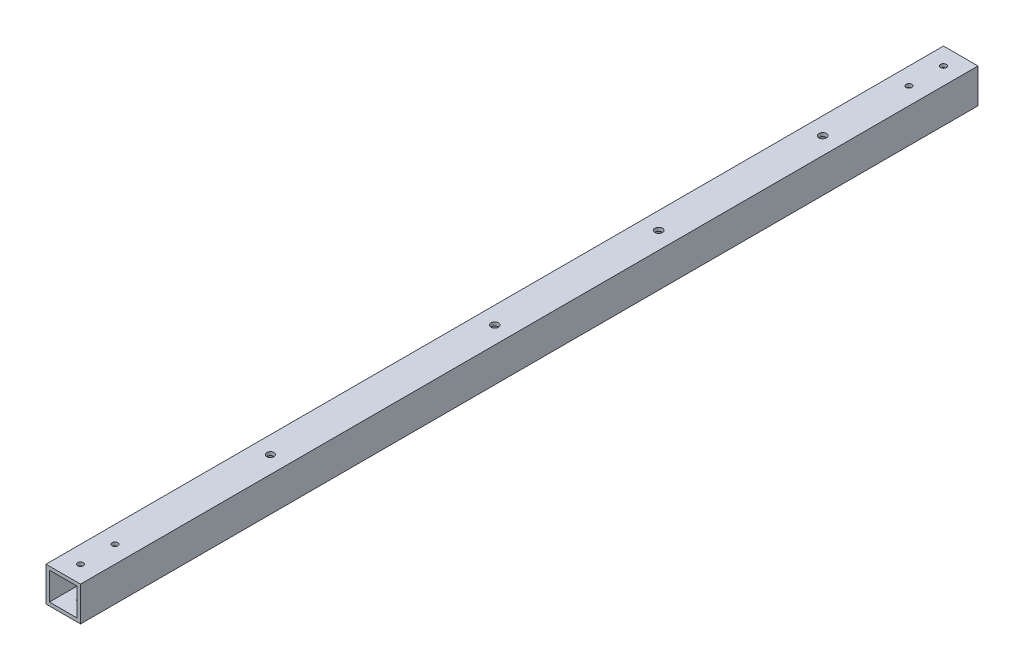
ISO-10303-21;
HEADER;
FILE_DESCRIPTION(('STEP AP214'),'2;1');
FILE_NAME('part.step','',(''),(''),'','','');
FILE_SCHEMA(('AUTOMOTIVE_DESIGN { 1 0 10303 214 1 1 1 1 }'));
ENDSEC;
DATA;
#1=APPLICATION_CONTEXT('core data for automotive mechanical design processes');
#2=APPLICATION_PROTOCOL_DEFINITION('international standard','automotive_design',2000,#1);
#3=PRODUCT_CONTEXT('',#1,'mechanical');
#4=PRODUCT('Part','Part','',(#3));
#5=PRODUCT_RELATED_PRODUCT_CATEGORY('part','',(#4));
#6=PRODUCT_DEFINITION_FORMATION('','',#4);
#7=PRODUCT_DEFINITION_CONTEXT('part definition',#1,'design');
#8=PRODUCT_DEFINITION('design','',#6,#7);
#9=PRODUCT_DEFINITION_SHAPE('','',#8);
#10=(LENGTH_UNIT() NAMED_UNIT(*) SI_UNIT(.MILLI.,.METRE.));
#11=(NAMED_UNIT(*) PLANE_ANGLE_UNIT() SI_UNIT($,.RADIAN.));
#12=(NAMED_UNIT(*) SI_UNIT($,.STERADIAN.) SOLID_ANGLE_UNIT());
#13=UNCERTAINTY_MEASURE_WITH_UNIT(LENGTH_MEASURE(1.E-05),#10,'distance_accuracy_value','');
#14=(GEOMETRIC_REPRESENTATION_CONTEXT(3) GLOBAL_UNCERTAINTY_ASSIGNED_CONTEXT((#13)) GLOBAL_UNIT_ASSIGNED_CONTEXT((#10,
#11,#12)) REPRESENTATION_CONTEXT('',''));
#15=CARTESIAN_POINT('',(0.,0.,0.));
#16=DIRECTION('',(0.,0.,1.));
#17=DIRECTION('',(1.,0.,0.));
#18=AXIS2_PLACEMENT_3D('',#15,#16,#17);
#19=CARTESIAN_POINT('',(-10.,-10.,560.));
#20=DIRECTION('',(0.,1.,0.));
#21=DIRECTION('',(0.,0.,1.));
#22=AXIS2_PLACEMENT_3D('',#19,#20,#21);
#23=PLANE('',#22);
#24=CARTESIAN_POINT('',(0.,-10.,530.));
#25=DIRECTION('',(0.,-1.,0.));
#26=DIRECTION('',(0.,0.,-1.));
#27=AXIS2_PLACEMENT_3D('',#24,#25,#26);
#28=CIRCLE('',#27,1.64999999999999);
#29=CARTESIAN_POINT('',(0.,-10.,528.35));
#30=VERTEX_POINT('',#29);
#31=EDGE_CURVE('E342',#30,#30,#28,.T.);
#32=ORIENTED_EDGE('',*,*,#31,.F.);
#33=EDGE_LOOP('',(#32));
#34=FACE_BOUND('',#33,.T.);
#35=CARTESIAN_POINT('',(0.,-10.,30.));
#36=DIRECTION('',(0.,-1.,0.));
#37=DIRECTION('',(0.,0.,-1.));
#38=AXIS2_PLACEMENT_3D('',#35,#36,#37);
#39=CIRCLE('',#38,1.64999999999999);
#40=CARTESIAN_POINT('',(0.,-10.,28.35));
#41=VERTEX_POINT('',#40);
#42=EDGE_CURVE('E361',#41,#41,#39,.T.);
#43=ORIENTED_EDGE('',*,*,#42,.F.);
#44=EDGE_LOOP('',(#43));
#45=FACE_BOUND('',#44,.T.);
#46=DIRECTION('',(1.,0.,0.));
#47=VECTOR('',#46,1.);
#48=CARTESIAN_POINT('',(-10.,-10.,540.));
#49=LINE('',#48,#47);
#50=CARTESIAN_POINT('',(-10.,-10.,540.));
#51=VERTEX_POINT('',#50);
#52=CARTESIAN_POINT('',(10.,-10.,540.));
#53=VERTEX_POINT('',#52);
#54=EDGE_CURVE('E200',#51,#53,#49,.T.);
#55=ORIENTED_EDGE('',*,*,#54,.F.);
#56=DIRECTION('',(0.,0.,-1.));
#57=VECTOR('',#56,1.);
#58=CARTESIAN_POINT('',(-10.,-10.,560.));
#59=LINE('',#58,#57);
#60=CARTESIAN_POINT('',(-10.,-10.,20.));
#61=VERTEX_POINT('',#60);
#62=EDGE_CURVE('E138',#51,#61,#59,.T.);
#63=ORIENTED_EDGE('',*,*,#62,.T.);
#64=DIRECTION('',(-1.,0.,0.));
#65=VECTOR('',#64,1.);
#66=CARTESIAN_POINT('',(-10.,-10.,20.));
#67=LINE('',#66,#65);
#68=CARTESIAN_POINT('',(10.,-10.,20.));
#69=VERTEX_POINT('',#68);
#70=EDGE_CURVE('E215',#69,#61,#67,.T.);
#71=ORIENTED_EDGE('',*,*,#70,.F.);
#72=DIRECTION('',(0.,0.,-1.));
#73=VECTOR('',#72,1.);
#74=CARTESIAN_POINT('',(10.,-10.,560.));
#75=LINE('',#74,#73);
#76=EDGE_CURVE('E136',#53,#69,#75,.T.);
#77=ORIENTED_EDGE('',*,*,#76,.F.);
#78=EDGE_LOOP('',(#55,#63,#71,#77));
#79=FACE_BOUND('',#78,.T.);
#80=CARTESIAN_POINT('',(0.,-10.,290.));
#81=DIRECTION('',(0.,-1.,0.));
#82=DIRECTION('',(0.,0.,-1.));
#83=AXIS2_PLACEMENT_3D('',#80,#81,#82);
#84=CIRCLE('',#83,2.19999999999998);
#85=CARTESIAN_POINT('',(0.,-10.,287.8));
#86=VERTEX_POINT('',#85);
#87=EDGE_CURVE('E163',#86,#86,#84,.T.);
#88=ORIENTED_EDGE('',*,*,#87,.F.);
#89=EDGE_LOOP('',(#88));
#90=FACE_BOUND('',#89,.T.);
#91=CARTESIAN_POINT('',(0.,-10.,195.));
#92=DIRECTION('',(0.,-1.,0.));
#93=DIRECTION('',(0.,0.,-1.));
#94=AXIS2_PLACEMENT_3D('',#91,#92,#93);
#95=CIRCLE('',#94,2.2);
#96=CARTESIAN_POINT('',(0.,-10.,192.8));
#97=VERTEX_POINT('',#96);
#98=EDGE_CURVE('E184',#97,#97,#95,.T.);
#99=ORIENTED_EDGE('',*,*,#98,.F.);
#100=EDGE_LOOP('',(#99));
#101=FACE_BOUND('',#100,.T.);
#102=CARTESIAN_POINT('',(0.,-10.,100.));
#103=DIRECTION('',(0.,-1.,0.));
#104=DIRECTION('',(0.,0.,-1.));
#105=AXIS2_PLACEMENT_3D('',#102,#103,#104);
#106=CIRCLE('',#105,2.2);
#107=CARTESIAN_POINT('',(0.,-10.,97.8));
#108=VERTEX_POINT('',#107);
#109=EDGE_CURVE('E178',#108,#108,#106,.T.);
#110=ORIENTED_EDGE('',*,*,#109,.F.);
#111=EDGE_LOOP('',(#110));
#112=FACE_BOUND('',#111,.T.);
#113=CARTESIAN_POINT('',(0.,-10.,420.));
#114=DIRECTION('',(0.,-1.,0.));
#115=DIRECTION('',(0.,0.,-1.));
#116=AXIS2_PLACEMENT_3D('',#113,#114,#115);
#117=CIRCLE('',#116,2.09999999999999);
#118=CARTESIAN_POINT('',(0.,-10.,417.9));
#119=VERTEX_POINT('',#118);
#120=EDGE_CURVE('E166',#119,#119,#117,.T.);
#121=ORIENTED_EDGE('',*,*,#120,.F.);
#122=EDGE_LOOP('',(#121));
#123=FACE_BOUND('',#122,.T.);
#124=CARTESIAN_POINT('',(0.,-10.,50.));
#125=DIRECTION('',(0.,-1.,0.));
#126=DIRECTION('',(0.,0.,-1.));
#127=AXIS2_PLACEMENT_3D('',#124,#125,#126);
#128=CIRCLE('',#127,1.64999999999999);
#129=CARTESIAN_POINT('',(0.,-10.,48.35));
#130=VERTEX_POINT('',#129);
#131=EDGE_CURVE('E371',#130,#130,#128,.T.);
#132=ORIENTED_EDGE('',*,*,#131,.F.);
#133=EDGE_LOOP('',(#132));
#134=FACE_BOUND('',#133,.T.);
#135=CARTESIAN_POINT('',(0.,-10.,510.));
#136=DIRECTION('',(0.,-1.,0.));
#137=DIRECTION('',(0.,0.,-1.));
#138=AXIS2_PLACEMENT_3D('',#135,#136,#137);
#139=CIRCLE('',#138,1.64999999999999);
#140=CARTESIAN_POINT('',(0.,-10.,508.35));
#141=VERTEX_POINT('',#140);
#142=EDGE_CURVE('E351',#141,#141,#139,.T.);
#143=ORIENTED_EDGE('',*,*,#142,.F.);
#144=EDGE_LOOP('',(#143));
#145=FACE_BOUND('',#144,.T.);
#146=ADVANCED_FACE('F44',(#34,#45,#79,#90,#101,#112,#123,#134,#145),#23,.F.);
#147=CARTESIAN_POINT('',(10.,10.,560.));
#148=DIRECTION('',(-1.,0.,0.));
#149=DIRECTION('',(0.,0.,1.));
#150=AXIS2_PLACEMENT_3D('',#147,#148,#149);
#151=PLANE('',#150);
#152=DIRECTION('',(0.,1.,0.));
#153=VECTOR('',#152,1.);
#154=CARTESIAN_POINT('',(10.,10.,540.));
#155=LINE('',#154,#153);
#156=CARTESIAN_POINT('',(10.,10.,540.));
#157=VERTEX_POINT('',#156);
#158=EDGE_CURVE('E205',#53,#157,#155,.T.);
#159=ORIENTED_EDGE('',*,*,#158,.F.);
#160=ORIENTED_EDGE('',*,*,#76,.T.);
#161=DIRECTION('',(0.,-1.,0.));
#162=VECTOR('',#161,1.);
#163=CARTESIAN_POINT('',(10.,10.,20.));
#164=LINE('',#163,#162);
#165=CARTESIAN_POINT('',(10.,10.,20.));
#166=VERTEX_POINT('',#165);
#167=EDGE_CURVE('E131',#166,#69,#164,.T.);
#168=ORIENTED_EDGE('',*,*,#167,.F.);
#169=DIRECTION('',(0.,0.,-1.));
#170=VECTOR('',#169,1.);
#171=CARTESIAN_POINT('',(10.,10.,560.));
#172=LINE('',#171,#170);
#173=EDGE_CURVE('E142',#157,#166,#172,.T.);
#174=ORIENTED_EDGE('',*,*,#173,.F.);
#175=EDGE_LOOP('',(#159,#160,#168,#174));
#176=FACE_BOUND('',#175,.T.);
#177=ADVANCED_FACE('F46',(#176),#151,.F.);
#178=CARTESIAN_POINT('',(-10.,10.,560.));
#179=DIRECTION('',(0.,-1.,0.));
#180=DIRECTION('',(1.,0.,0.));
#181=AXIS2_PLACEMENT_3D('',#178,#179,#180);
#182=PLANE('',#181);
#183=CARTESIAN_POINT('',(0.,10.,530.));
#184=DIRECTION('',(0.,-1.,0.));
#185=DIRECTION('',(0.,0.,-1.));
#186=AXIS2_PLACEMENT_3D('',#183,#184,#185);
#187=CIRCLE('',#186,1.65);
#188=CARTESIAN_POINT('',(0.,10.,528.35));
#189=VERTEX_POINT('',#188);
#190=EDGE_CURVE('E276',#189,#189,#187,.T.);
#191=ORIENTED_EDGE('',*,*,#190,.T.);
#192=EDGE_LOOP('',(#191));
#193=FACE_BOUND('',#192,.T.);
#194=CARTESIAN_POINT('',(0.,10.,510.));
#195=DIRECTION('',(0.,-1.,0.));
#196=DIRECTION('',(0.,0.,-1.));
#197=AXIS2_PLACEMENT_3D('',#194,#195,#196);
#198=CIRCLE('',#197,1.65);
#199=CARTESIAN_POINT('',(0.,10.,508.35));
#200=VERTEX_POINT('',#199);
#201=EDGE_CURVE('E280',#200,#200,#198,.T.);
#202=ORIENTED_EDGE('',*,*,#201,.T.);
#203=EDGE_LOOP('',(#202));
#204=FACE_BOUND('',#203,.T.);
#205=CARTESIAN_POINT('',(0.,10.,30.));
#206=DIRECTION('',(0.,-1.,0.));
#207=DIRECTION('',(0.,0.,-1.));
#208=AXIS2_PLACEMENT_3D('',#205,#206,#207);
#209=CIRCLE('',#208,1.65);
#210=CARTESIAN_POINT('',(0.,10.,28.35));
#211=VERTEX_POINT('',#210);
#212=EDGE_CURVE('E284',#211,#211,#209,.T.);
#213=ORIENTED_EDGE('',*,*,#212,.T.);
#214=EDGE_LOOP('',(#213));
#215=FACE_BOUND('',#214,.T.);
#216=CARTESIAN_POINT('',(0.,10.,50.));
#217=DIRECTION('',(0.,-1.,0.));
#218=DIRECTION('',(0.,0.,-1.));
#219=AXIS2_PLACEMENT_3D('',#216,#217,#218);
#220=CIRCLE('',#219,1.65);
#221=CARTESIAN_POINT('',(0.,10.,48.35));
#222=VERTEX_POINT('',#221);
#223=EDGE_CURVE('E287',#222,#222,#220,.T.);
#224=ORIENTED_EDGE('',*,*,#223,.T.);
#225=EDGE_LOOP('',(#224));
#226=FACE_BOUND('',#225,.T.);
#227=CARTESIAN_POINT('',(0.,10.,420.));
#228=DIRECTION('',(0.,-1.,0.));
#229=DIRECTION('',(0.,0.,-1.));
#230=AXIS2_PLACEMENT_3D('',#227,#228,#229);
#231=CIRCLE('',#230,2.09999999999999);
#232=CARTESIAN_POINT('',(0.,10.,417.9));
#233=VERTEX_POINT('',#232);
#234=EDGE_CURVE('E159',#233,#233,#231,.T.);
#235=ORIENTED_EDGE('',*,*,#234,.T.);
#236=EDGE_LOOP('',(#235));
#237=FACE_BOUND('',#236,.T.);
#238=CARTESIAN_POINT('',(0.,10.,100.));
#239=DIRECTION('',(0.,-1.,0.));
#240=DIRECTION('',(0.,0.,-1.));
#241=AXIS2_PLACEMENT_3D('',#238,#239,#240);
#242=CIRCLE('',#241,2.2);
#243=CARTESIAN_POINT('',(0.,10.,97.8));
#244=VERTEX_POINT('',#243);
#245=EDGE_CURVE('E149',#244,#244,#242,.T.);
#246=ORIENTED_EDGE('',*,*,#245,.T.);
#247=EDGE_LOOP('',(#246));
#248=FACE_BOUND('',#247,.T.);
#249=CARTESIAN_POINT('',(0.,10.,195.));
#250=DIRECTION('',(0.,-1.,0.));
#251=DIRECTION('',(0.,0.,-1.));
#252=AXIS2_PLACEMENT_3D('',#249,#250,#251);
#253=CIRCLE('',#252,2.2);
#254=CARTESIAN_POINT('',(0.,10.,192.8));
#255=VERTEX_POINT('',#254);
#256=EDGE_CURVE('E181',#255,#255,#253,.T.);
#257=ORIENTED_EDGE('',*,*,#256,.T.);
#258=EDGE_LOOP('',(#257));
#259=FACE_BOUND('',#258,.T.);
#260=CARTESIAN_POINT('',(0.,10.,290.));
#261=DIRECTION('',(0.,-1.,0.));
#262=DIRECTION('',(0.,0.,-1.));
#263=AXIS2_PLACEMENT_3D('',#260,#261,#262);
#264=CIRCLE('',#263,2.19999999999998);
#265=CARTESIAN_POINT('',(0.,10.,287.8));
#266=VERTEX_POINT('',#265);
#267=EDGE_CURVE('E187',#266,#266,#264,.T.);
#268=ORIENTED_EDGE('',*,*,#267,.T.);
#269=EDGE_LOOP('',(#268));
#270=FACE_BOUND('',#269,.T.);
#271=DIRECTION('',(-1.,0.,0.));
#272=VECTOR('',#271,1.);
#273=CARTESIAN_POINT('',(-10.,10.,540.));
#274=LINE('',#273,#272);
#275=CARTESIAN_POINT('',(-10.,10.,540.));
#276=VERTEX_POINT('',#275);
#277=EDGE_CURVE('E203',#157,#276,#274,.T.);
#278=ORIENTED_EDGE('',*,*,#277,.F.);
#279=ORIENTED_EDGE('',*,*,#173,.T.);
#280=DIRECTION('',(1.,0.,0.));
#281=VECTOR('',#280,1.);
#282=CARTESIAN_POINT('',(-10.,10.,20.));
#283=LINE('',#282,#281);
#284=CARTESIAN_POINT('',(-10.,10.,20.));
#285=VERTEX_POINT('',#284);
#286=EDGE_CURVE('E221',#285,#166,#283,.T.);
#287=ORIENTED_EDGE('',*,*,#286,.F.);
#288=DIRECTION('',(0.,0.,-1.));
#289=VECTOR('',#288,1.);
#290=CARTESIAN_POINT('',(-10.,10.,560.));
#291=LINE('',#290,#289);
#292=EDGE_CURVE('E140',#276,#285,#291,.T.);
#293=ORIENTED_EDGE('',*,*,#292,.F.);
#294=EDGE_LOOP('',(#278,#279,#287,#293));
#295=FACE_BOUND('',#294,.T.);
#296=ADVANCED_FACE('F241',(#193,#204,#215,#226,#237,#248,#259,#270,#295),#182,.F.);
#297=CARTESIAN_POINT('',(-10.,10.,560.));
#298=DIRECTION('',(1.,0.,0.));
#299=DIRECTION('',(0.,1.,0.));
#300=AXIS2_PLACEMENT_3D('',#297,#298,#299);
#301=PLANE('',#300);
#302=DIRECTION('',(0.,-1.,0.));
#303=VECTOR('',#302,1.);
#304=CARTESIAN_POINT('',(-10.,10.,540.));
#305=LINE('',#304,#303);
#306=EDGE_CURVE('E61',#276,#51,#305,.T.);
#307=ORIENTED_EDGE('',*,*,#306,.F.);
#308=ORIENTED_EDGE('',*,*,#292,.T.);
#309=DIRECTION('',(0.,1.,0.));
#310=VECTOR('',#309,1.);
#311=CARTESIAN_POINT('',(-10.,10.,20.));
#312=LINE('',#311,#310);
#313=EDGE_CURVE('E218',#61,#285,#312,.T.);
#314=ORIENTED_EDGE('',*,*,#313,.F.);
#315=ORIENTED_EDGE('',*,*,#62,.F.);
#316=EDGE_LOOP('',(#307,#308,#314,#315));
#317=FACE_BOUND('',#316,.T.);
#318=ADVANCED_FACE('F237',(#317),#301,.F.);
#319=CARTESIAN_POINT('',(8.,8.,560.));
#320=DIRECTION('',(-1.,0.,0.));
#321=DIRECTION('',(0.,0.,1.));
#322=AXIS2_PLACEMENT_3D('',#319,#320,#321);
#323=PLANE('',#322);
#324=DIRECTION('',(0.,0.,-1.));
#325=VECTOR('',#324,1.);
#326=CARTESIAN_POINT('',(8.,-8.,560.));
#327=LINE('',#326,#325);
#328=CARTESIAN_POINT('',(8.,-8.,540.));
#329=VERTEX_POINT('',#328);
#330=CARTESIAN_POINT('',(8.,-8.,20.));
#331=VERTEX_POINT('',#330);
#332=EDGE_CURVE('E127',#329,#331,#327,.T.);
#333=ORIENTED_EDGE('',*,*,#332,.F.);
#334=DIRECTION('',(0.,1.,0.));
#335=VECTOR('',#334,1.);
#336=CARTESIAN_POINT('',(8.,8.,540.));
#337=LINE('',#336,#335);
#338=CARTESIAN_POINT('',(8.,8.,540.));
#339=VERTEX_POINT('',#338);
#340=EDGE_CURVE('E69',#329,#339,#337,.T.);
#341=ORIENTED_EDGE('',*,*,#340,.T.);
#342=DIRECTION('',(0.,0.,-1.));
#343=VECTOR('',#342,1.);
#344=CARTESIAN_POINT('',(8.,8.,560.));
#345=LINE('',#344,#343);
#346=CARTESIAN_POINT('',(8.,8.,20.));
#347=VERTEX_POINT('',#346);
#348=EDGE_CURVE('E129',#339,#347,#345,.T.);
#349=ORIENTED_EDGE('',*,*,#348,.T.);
#350=DIRECTION('',(0.,-1.,0.));
#351=VECTOR('',#350,1.);
#352=CARTESIAN_POINT('',(8.,8.,20.));
#353=LINE('',#352,#351);
#354=EDGE_CURVE('E212',#347,#331,#353,.T.);
#355=ORIENTED_EDGE('',*,*,#354,.T.);
#356=EDGE_LOOP('',(#333,#341,#349,#355));
#357=FACE_BOUND('',#356,.T.);
#358=ADVANCED_FACE('F266',(#357),#323,.T.);
#359=CARTESIAN_POINT('',(-8.,8.,560.));
#360=DIRECTION('',(0.,-1.,0.));
#361=DIRECTION('',(0.,0.,-1.));
#362=AXIS2_PLACEMENT_3D('',#359,#360,#361);
#363=PLANE('',#362);
#364=CARTESIAN_POINT('',(0.,8.,530.));
#365=DIRECTION('',(0.,-1.,0.));
#366=DIRECTION('',(0.,0.,-1.));
#367=AXIS2_PLACEMENT_3D('',#364,#365,#366);
#368=CIRCLE('',#367,1.64999999999999);
#369=CARTESIAN_POINT('',(0.,8.,528.35));
#370=VERTEX_POINT('',#369);
#371=EDGE_CURVE('E341',#370,#370,#368,.T.);
#372=ORIENTED_EDGE('',*,*,#371,.F.);
#373=EDGE_LOOP('',(#372));
#374=FACE_BOUND('',#373,.T.);
#375=CARTESIAN_POINT('',(0.,8.,510.));
#376=DIRECTION('',(0.,-1.,0.));
#377=DIRECTION('',(0.,0.,-1.));
#378=AXIS2_PLACEMENT_3D('',#375,#376,#377);
#379=CIRCLE('',#378,1.64999999999999);
#380=CARTESIAN_POINT('',(0.,8.,508.35));
#381=VERTEX_POINT('',#380);
#382=EDGE_CURVE('E355',#381,#381,#379,.T.);
#383=ORIENTED_EDGE('',*,*,#382,.F.);
#384=EDGE_LOOP('',(#383));
#385=FACE_BOUND('',#384,.T.);
#386=CARTESIAN_POINT('',(0.,8.,30.));
#387=DIRECTION('',(0.,-1.,0.));
#388=DIRECTION('',(0.,0.,-1.));
#389=AXIS2_PLACEMENT_3D('',#386,#387,#388);
#390=CIRCLE('',#389,1.64999999999999);
#391=CARTESIAN_POINT('',(0.,8.,28.35));
#392=VERTEX_POINT('',#391);
#393=EDGE_CURVE('E365',#392,#392,#390,.T.);
#394=ORIENTED_EDGE('',*,*,#393,.F.);
#395=EDGE_LOOP('',(#394));
#396=FACE_BOUND('',#395,.T.);
#397=CARTESIAN_POINT('',(0.,8.,50.));
#398=DIRECTION('',(0.,-1.,0.));
#399=DIRECTION('',(0.,0.,-1.));
#400=AXIS2_PLACEMENT_3D('',#397,#398,#399);
#401=CIRCLE('',#400,1.64999999999999);
#402=CARTESIAN_POINT('',(0.,8.,48.35));
#403=VERTEX_POINT('',#402);
#404=EDGE_CURVE('E171',#403,#403,#401,.T.);
#405=ORIENTED_EDGE('',*,*,#404,.F.);
#406=EDGE_LOOP('',(#405));
#407=FACE_BOUND('',#406,.T.);
#408=CARTESIAN_POINT('',(0.,8.,420.));
#409=DIRECTION('',(0.,-1.,0.));
#410=DIRECTION('',(0.,0.,-1.));
#411=AXIS2_PLACEMENT_3D('',#408,#409,#410);
#412=CIRCLE('',#411,2.09999999999999);
#413=CARTESIAN_POINT('',(0.,8.,417.9));
#414=VERTEX_POINT('',#413);
#415=EDGE_CURVE('E158',#414,#414,#412,.T.);
#416=ORIENTED_EDGE('',*,*,#415,.F.);
#417=EDGE_LOOP('',(#416));
#418=FACE_BOUND('',#417,.T.);
#419=CARTESIAN_POINT('',(0.,8.,100.));
#420=DIRECTION('',(0.,-1.,0.));
#421=DIRECTION('',(0.,0.,-1.));
#422=AXIS2_PLACEMENT_3D('',#419,#420,#421);
#423=CIRCLE('',#422,2.2);
#424=CARTESIAN_POINT('',(0.,8.,97.8));
#425=VERTEX_POINT('',#424);
#426=EDGE_CURVE('E122',#425,#425,#423,.T.);
#427=ORIENTED_EDGE('',*,*,#426,.F.);
#428=EDGE_LOOP('',(#427));
#429=FACE_BOUND('',#428,.T.);
#430=CARTESIAN_POINT('',(0.,8.,195.));
#431=DIRECTION('',(0.,-1.,0.));
#432=DIRECTION('',(0.,0.,-1.));
#433=AXIS2_PLACEMENT_3D('',#430,#431,#432);
#434=CIRCLE('',#433,2.2);
#435=CARTESIAN_POINT('',(0.,8.,192.8));
#436=VERTEX_POINT('',#435);
#437=EDGE_CURVE('E153',#436,#436,#434,.T.);
#438=ORIENTED_EDGE('',*,*,#437,.F.);
#439=EDGE_LOOP('',(#438));
#440=FACE_BOUND('',#439,.T.);
#441=CARTESIAN_POINT('',(0.,8.,290.));
#442=DIRECTION('',(0.,-1.,0.));
#443=DIRECTION('',(0.,0.,-1.));
#444=AXIS2_PLACEMENT_3D('',#441,#442,#443);
#445=CIRCLE('',#444,2.19999999999998);
#446=CARTESIAN_POINT('',(0.,8.,287.8));
#447=VERTEX_POINT('',#446);
#448=EDGE_CURVE('E148',#447,#447,#445,.T.);
#449=ORIENTED_EDGE('',*,*,#448,.F.);
#450=EDGE_LOOP('',(#449));
#451=FACE_BOUND('',#450,.T.);
#452=ORIENTED_EDGE('',*,*,#348,.F.);
#453=DIRECTION('',(-1.,0.,0.));
#454=VECTOR('',#453,1.);
#455=CARTESIAN_POINT('',(-8.,8.,540.));
#456=LINE('',#455,#454);
#457=CARTESIAN_POINT('',(-8.,8.,540.));
#458=VERTEX_POINT('',#457);
#459=EDGE_CURVE('E121',#339,#458,#456,.T.);
#460=ORIENTED_EDGE('',*,*,#459,.T.);
#461=DIRECTION('',(0.,0.,-1.));
#462=VECTOR('',#461,1.);
#463=CARTESIAN_POINT('',(-8.,8.,560.));
#464=LINE('',#463,#462);
#465=CARTESIAN_POINT('',(-8.,8.,20.));
#466=VERTEX_POINT('',#465);
#467=EDGE_CURVE('E120',#458,#466,#464,.T.);
#468=ORIENTED_EDGE('',*,*,#467,.T.);
#469=DIRECTION('',(1.,0.,0.));
#470=VECTOR('',#469,1.);
#471=CARTESIAN_POINT('',(-8.,8.,20.));
#472=LINE('',#471,#470);
#473=EDGE_CURVE('E209',#466,#347,#472,.T.);
#474=ORIENTED_EDGE('',*,*,#473,.T.);
#475=EDGE_LOOP('',(#452,#460,#468,#474));
#476=FACE_BOUND('',#475,.T.);
#477=ADVANCED_FACE('F380',(#374,#385,#396,#407,#418,#429,#440,#451,#476),#363,.T.);
#478=CARTESIAN_POINT('',(-8.,8.,560.));
#479=DIRECTION('',(1.,0.,0.));
#480=DIRECTION('',(0.,0.,-1.));
#481=AXIS2_PLACEMENT_3D('',#478,#479,#480);
#482=PLANE('',#481);
#483=ORIENTED_EDGE('',*,*,#467,.F.);
#484=DIRECTION('',(0.,-1.,0.));
#485=VECTOR('',#484,1.);
#486=CARTESIAN_POINT('',(-8.,8.,540.));
#487=LINE('',#486,#485);
#488=CARTESIAN_POINT('',(-8.,-8.,540.));
#489=VERTEX_POINT('',#488);
#490=EDGE_CURVE('E109',#458,#489,#487,.T.);
#491=ORIENTED_EDGE('',*,*,#490,.T.);
#492=DIRECTION('',(0.,0.,-1.));
#493=VECTOR('',#492,1.);
#494=CARTESIAN_POINT('',(-8.,-8.,560.));
#495=LINE('',#494,#493);
#496=CARTESIAN_POINT('',(-8.,-8.,20.));
#497=VERTEX_POINT('',#496);
#498=EDGE_CURVE('E118',#489,#497,#495,.T.);
#499=ORIENTED_EDGE('',*,*,#498,.T.);
#500=DIRECTION('',(0.,1.,0.));
#501=VECTOR('',#500,1.);
#502=CARTESIAN_POINT('',(-8.,8.,20.));
#503=LINE('',#502,#501);
#504=EDGE_CURVE('E207',#497,#466,#503,.T.);
#505=ORIENTED_EDGE('',*,*,#504,.T.);
#506=EDGE_LOOP('',(#483,#491,#499,#505));
#507=FACE_BOUND('',#506,.T.);
#508=ADVANCED_FACE('F116',(#507),#482,.T.);
#509=CARTESIAN_POINT('',(-8.,-8.,560.));
#510=DIRECTION('',(0.,1.,0.));
#511=DIRECTION('',(0.,0.,1.));
#512=AXIS2_PLACEMENT_3D('',#509,#510,#511);
#513=PLANE('',#512);
#514=CARTESIAN_POINT('',(0.,-8.,530.));
#515=DIRECTION('',(0.,1.,0.));
#516=DIRECTION('',(0.,0.,1.));
#517=AXIS2_PLACEMENT_3D('',#514,#515,#516);
#518=CIRCLE('',#517,1.64999999999999);
#519=CARTESIAN_POINT('',(0.,-8.,531.65));
#520=VERTEX_POINT('',#519);
#521=EDGE_CURVE('E344',#520,#520,#518,.T.);
#522=ORIENTED_EDGE('',*,*,#521,.F.);
#523=EDGE_LOOP('',(#522));
#524=FACE_BOUND('',#523,.T.);
#525=CARTESIAN_POINT('',(0.,-8.,510.));
#526=DIRECTION('',(0.,1.,0.));
#527=DIRECTION('',(0.,0.,1.));
#528=AXIS2_PLACEMENT_3D('',#525,#526,#527);
#529=CIRCLE('',#528,1.64999999999999);
#530=CARTESIAN_POINT('',(0.,-8.,511.65));
#531=VERTEX_POINT('',#530);
#532=EDGE_CURVE('E358',#531,#531,#529,.T.);
#533=ORIENTED_EDGE('',*,*,#532,.F.);
#534=EDGE_LOOP('',(#533));
#535=FACE_BOUND('',#534,.T.);
#536=CARTESIAN_POINT('',(0.,-8.,30.));
#537=DIRECTION('',(0.,1.,0.));
#538=DIRECTION('',(0.,0.,1.));
#539=AXIS2_PLACEMENT_3D('',#536,#537,#538);
#540=CIRCLE('',#539,1.64999999999999);
#541=CARTESIAN_POINT('',(0.,-8.,31.65));
#542=VERTEX_POINT('',#541);
#543=EDGE_CURVE('E368',#542,#542,#540,.T.);
#544=ORIENTED_EDGE('',*,*,#543,.F.);
#545=EDGE_LOOP('',(#544));
#546=FACE_BOUND('',#545,.T.);
#547=CARTESIAN_POINT('',(0.,-8.,50.));
#548=DIRECTION('',(0.,1.,0.));
#549=DIRECTION('',(0.,0.,1.));
#550=AXIS2_PLACEMENT_3D('',#547,#548,#549);
#551=CIRCLE('',#550,1.64999999999999);
#552=CARTESIAN_POINT('',(0.,-8.,51.65));
#553=VERTEX_POINT('',#552);
#554=EDGE_CURVE('E48',#553,#553,#551,.T.);
#555=ORIENTED_EDGE('',*,*,#554,.F.);
#556=EDGE_LOOP('',(#555));
#557=FACE_BOUND('',#556,.T.);
#558=CARTESIAN_POINT('',(0.,-8.,420.));
#559=DIRECTION('',(0.,1.,0.));
#560=DIRECTION('',(0.,0.,1.));
#561=AXIS2_PLACEMENT_3D('',#558,#559,#560);
#562=CIRCLE('',#561,2.09999999999999);
#563=CARTESIAN_POINT('',(0.,-8.,422.1));
#564=VERTEX_POINT('',#563);
#565=EDGE_CURVE('E156',#564,#564,#562,.T.);
#566=ORIENTED_EDGE('',*,*,#565,.F.);
#567=EDGE_LOOP('',(#566));
#568=FACE_BOUND('',#567,.T.);
#569=CARTESIAN_POINT('',(0.,-8.,100.));
#570=DIRECTION('',(0.,1.,0.));
#571=DIRECTION('',(0.,0.,1.));
#572=AXIS2_PLACEMENT_3D('',#569,#570,#571);
#573=CIRCLE('',#572,2.2);
#574=CARTESIAN_POINT('',(0.,-8.,102.2));
#575=VERTEX_POINT('',#574);
#576=EDGE_CURVE('E154',#575,#575,#573,.T.);
#577=ORIENTED_EDGE('',*,*,#576,.F.);
#578=EDGE_LOOP('',(#577));
#579=FACE_BOUND('',#578,.T.);
#580=CARTESIAN_POINT('',(0.,-8.,195.));
#581=DIRECTION('',(0.,1.,0.));
#582=DIRECTION('',(0.,0.,1.));
#583=AXIS2_PLACEMENT_3D('',#580,#581,#582);
#584=CIRCLE('',#583,2.2);
#585=CARTESIAN_POINT('',(0.,-8.,197.2));
#586=VERTEX_POINT('',#585);
#587=EDGE_CURVE('E150',#586,#586,#584,.T.);
#588=ORIENTED_EDGE('',*,*,#587,.F.);
#589=EDGE_LOOP('',(#588));
#590=FACE_BOUND('',#589,.T.);
#591=CARTESIAN_POINT('',(0.,-8.,290.));
#592=DIRECTION('',(0.,1.,0.));
#593=DIRECTION('',(0.,0.,1.));
#594=AXIS2_PLACEMENT_3D('',#591,#592,#593);
#595=CIRCLE('',#594,2.19999999999998);
#596=CARTESIAN_POINT('',(0.,-8.,292.2));
#597=VERTEX_POINT('',#596);
#598=EDGE_CURVE('E145',#597,#597,#595,.T.);
#599=ORIENTED_EDGE('',*,*,#598,.F.);
#600=EDGE_LOOP('',(#599));
#601=FACE_BOUND('',#600,.T.);
#602=ORIENTED_EDGE('',*,*,#498,.F.);
#603=DIRECTION('',(1.,0.,0.));
#604=VECTOR('',#603,1.);
#605=CARTESIAN_POINT('',(-8.,-8.,540.));
#606=LINE('',#605,#604);
#607=EDGE_CURVE('E12',#489,#329,#606,.T.);
#608=ORIENTED_EDGE('',*,*,#607,.T.);
#609=ORIENTED_EDGE('',*,*,#332,.T.);
#610=DIRECTION('',(-1.,0.,0.));
#611=VECTOR('',#610,1.);
#612=CARTESIAN_POINT('',(-8.,-8.,20.));
#613=LINE('',#612,#611);
#614=EDGE_CURVE('E53',#331,#497,#613,.T.);
#615=ORIENTED_EDGE('',*,*,#614,.T.);
#616=EDGE_LOOP('',(#602,#608,#609,#615));
#617=FACE_BOUND('',#616,.T.);
#618=ADVANCED_FACE('F125',(#524,#535,#546,#557,#568,#579,#590,#601,#617),#513,.T.);
#619=CARTESIAN_POINT('',(0.,0.,20.));
#620=DIRECTION('',(0.,0.,-1.));
#621=DIRECTION('',(-1.,0.,0.));
#622=AXIS2_PLACEMENT_3D('',#619,#620,#621);
#623=PLANE('',#622);
#624=ORIENTED_EDGE('',*,*,#473,.F.);
#625=ORIENTED_EDGE('',*,*,#504,.F.);
#626=ORIENTED_EDGE('',*,*,#614,.F.);
#627=ORIENTED_EDGE('',*,*,#354,.F.);
#628=EDGE_LOOP('',(#624,#625,#626,#627));
#629=FACE_BOUND('',#628,.T.);
#630=ORIENTED_EDGE('',*,*,#167,.T.);
#631=ORIENTED_EDGE('',*,*,#70,.T.);
#632=ORIENTED_EDGE('',*,*,#313,.T.);
#633=ORIENTED_EDGE('',*,*,#286,.T.);
#634=EDGE_LOOP('',(#630,#631,#632,#633));
#635=FACE_BOUND('',#634,.T.);
#636=ADVANCED_FACE('F227',(#629,#635),#623,.T.);
#637=CARTESIAN_POINT('',(0.,0.,540.));
#638=DIRECTION('',(0.,0.,1.));
#639=DIRECTION('',(1.,0.,0.));
#640=AXIS2_PLACEMENT_3D('',#637,#638,#639);
#641=PLANE('',#640);
#642=ORIENTED_EDGE('',*,*,#607,.F.);
#643=ORIENTED_EDGE('',*,*,#490,.F.);
#644=ORIENTED_EDGE('',*,*,#459,.F.);
#645=ORIENTED_EDGE('',*,*,#340,.F.);
#646=EDGE_LOOP('',(#642,#643,#644,#645));
#647=FACE_BOUND('',#646,.T.);
#648=ORIENTED_EDGE('',*,*,#158,.T.);
#649=ORIENTED_EDGE('',*,*,#277,.T.);
#650=ORIENTED_EDGE('',*,*,#306,.T.);
#651=ORIENTED_EDGE('',*,*,#54,.T.);
#652=EDGE_LOOP('',(#648,#649,#650,#651));
#653=FACE_BOUND('',#652,.T.);
#654=ADVANCED_FACE('F108',(#647,#653),#641,.T.);
#655=CARTESIAN_POINT('',(0.,10.,290.));
#656=DIRECTION('',(0.,-1.,0.));
#657=DIRECTION('',(0.,0.,-1.));
#658=AXIS2_PLACEMENT_3D('',#655,#656,#657);
#659=CYLINDRICAL_SURFACE('',#658,2.19999999999998);
#660=ORIENTED_EDGE('',*,*,#598,.T.);
#661=EDGE_LOOP('',(#660));
#662=FACE_BOUND('',#661,.T.);
#663=ORIENTED_EDGE('',*,*,#87,.T.);
#664=EDGE_LOOP('',(#663));
#665=FACE_BOUND('',#664,.T.);
#666=ADVANCED_FACE('F244',(#662,#665),#659,.F.);
#667=CARTESIAN_POINT('',(0.,10.,195.));
#668=DIRECTION('',(0.,-1.,0.));
#669=DIRECTION('',(0.,0.,-1.));
#670=AXIS2_PLACEMENT_3D('',#667,#668,#669);
#671=CYLINDRICAL_SURFACE('',#670,2.2);
#672=ORIENTED_EDGE('',*,*,#587,.T.);
#673=EDGE_LOOP('',(#672));
#674=FACE_BOUND('',#673,.T.);
#675=ORIENTED_EDGE('',*,*,#98,.T.);
#676=EDGE_LOOP('',(#675));
#677=FACE_BOUND('',#676,.T.);
#678=ADVANCED_FACE('F250',(#674,#677),#671,.F.);
#679=CARTESIAN_POINT('',(0.,10.,100.));
#680=DIRECTION('',(0.,-1.,0.));
#681=DIRECTION('',(0.,0.,-1.));
#682=AXIS2_PLACEMENT_3D('',#679,#680,#681);
#683=CYLINDRICAL_SURFACE('',#682,2.2);
#684=ORIENTED_EDGE('',*,*,#576,.T.);
#685=EDGE_LOOP('',(#684));
#686=FACE_BOUND('',#685,.T.);
#687=ORIENTED_EDGE('',*,*,#109,.T.);
#688=EDGE_LOOP('',(#687));
#689=FACE_BOUND('',#688,.T.);
#690=ADVANCED_FACE('F297',(#686,#689),#683,.F.);
#691=ORIENTED_EDGE('',*,*,#448,.T.);
#692=EDGE_LOOP('',(#691));
#693=FACE_BOUND('',#692,.T.);
#694=ORIENTED_EDGE('',*,*,#267,.F.);
#695=EDGE_LOOP('',(#694));
#696=FACE_BOUND('',#695,.T.);
#697=ADVANCED_FACE('F253',(#693,#696),#659,.F.);
#698=ORIENTED_EDGE('',*,*,#437,.T.);
#699=EDGE_LOOP('',(#698));
#700=FACE_BOUND('',#699,.T.);
#701=ORIENTED_EDGE('',*,*,#256,.F.);
#702=EDGE_LOOP('',(#701));
#703=FACE_BOUND('',#702,.T.);
#704=ADVANCED_FACE('F296',(#700,#703),#671,.F.);
#705=ORIENTED_EDGE('',*,*,#426,.T.);
#706=EDGE_LOOP('',(#705));
#707=FACE_BOUND('',#706,.T.);
#708=ORIENTED_EDGE('',*,*,#245,.F.);
#709=EDGE_LOOP('',(#708));
#710=FACE_BOUND('',#709,.T.);
#711=ADVANCED_FACE('F303',(#707,#710),#683,.F.);
#712=CARTESIAN_POINT('',(0.,10.,420.));
#713=DIRECTION('',(0.,-1.,0.));
#714=DIRECTION('',(0.,0.,-1.));
#715=AXIS2_PLACEMENT_3D('',#712,#713,#714);
#716=CYLINDRICAL_SURFACE('',#715,2.09999999999999);
#717=ORIENTED_EDGE('',*,*,#565,.T.);
#718=EDGE_LOOP('',(#717));
#719=FACE_BOUND('',#718,.T.);
#720=ORIENTED_EDGE('',*,*,#120,.T.);
#721=EDGE_LOOP('',(#720));
#722=FACE_BOUND('',#721,.T.);
#723=ADVANCED_FACE('F311',(#719,#722),#716,.F.);
#724=ORIENTED_EDGE('',*,*,#415,.T.);
#725=EDGE_LOOP('',(#724));
#726=FACE_BOUND('',#725,.T.);
#727=ORIENTED_EDGE('',*,*,#234,.F.);
#728=EDGE_LOOP('',(#727));
#729=FACE_BOUND('',#728,.T.);
#730=ADVANCED_FACE('F314',(#726,#729),#716,.F.);
#731=CARTESIAN_POINT('',(0.,-10.,50.));
#732=DIRECTION('',(0.,-1.,0.));
#733=DIRECTION('',(0.,0.,-1.));
#734=AXIS2_PLACEMENT_3D('',#731,#732,#733);
#735=CYLINDRICAL_SURFACE('',#734,1.64999999999999);
#736=ORIENTED_EDGE('',*,*,#554,.T.);
#737=EDGE_LOOP('',(#736));
#738=FACE_BOUND('',#737,.T.);
#739=ORIENTED_EDGE('',*,*,#131,.T.);
#740=EDGE_LOOP('',(#739));
#741=FACE_BOUND('',#740,.T.);
#742=ADVANCED_FACE('F315',(#738,#741),#735,.F.);
#743=ORIENTED_EDGE('',*,*,#404,.T.);
#744=EDGE_LOOP('',(#743));
#745=FACE_BOUND('',#744,.T.);
#746=ORIENTED_EDGE('',*,*,#223,.F.);
#747=EDGE_LOOP('',(#746));
#748=FACE_BOUND('',#747,.T.);
#749=ADVANCED_FACE('F318',(#745,#748),#735,.F.);
#750=CARTESIAN_POINT('',(0.,-10.,30.));
#751=DIRECTION('',(0.,-1.,0.));
#752=DIRECTION('',(0.,0.,-1.));
#753=AXIS2_PLACEMENT_3D('',#750,#751,#752);
#754=CYLINDRICAL_SURFACE('',#753,1.64999999999999);
#755=ORIENTED_EDGE('',*,*,#393,.T.);
#756=EDGE_LOOP('',(#755));
#757=FACE_BOUND('',#756,.T.);
#758=ORIENTED_EDGE('',*,*,#212,.F.);
#759=EDGE_LOOP('',(#758));
#760=FACE_BOUND('',#759,.T.);
#761=ADVANCED_FACE('F320',(#757,#760),#754,.F.);
#762=ORIENTED_EDGE('',*,*,#543,.T.);
#763=EDGE_LOOP('',(#762));
#764=FACE_BOUND('',#763,.T.);
#765=ORIENTED_EDGE('',*,*,#42,.T.);
#766=EDGE_LOOP('',(#765));
#767=FACE_BOUND('',#766,.T.);
#768=ADVANCED_FACE('F323',(#764,#767),#754,.F.);
#769=CARTESIAN_POINT('',(0.,-10.,510.));
#770=DIRECTION('',(0.,-1.,0.));
#771=DIRECTION('',(0.,0.,-1.));
#772=AXIS2_PLACEMENT_3D('',#769,#770,#771);
#773=CYLINDRICAL_SURFACE('',#772,1.64999999999999);
#774=ORIENTED_EDGE('',*,*,#382,.T.);
#775=EDGE_LOOP('',(#774));
#776=FACE_BOUND('',#775,.T.);
#777=ORIENTED_EDGE('',*,*,#201,.F.);
#778=EDGE_LOOP('',(#777));
#779=FACE_BOUND('',#778,.T.);
#780=ADVANCED_FACE('F325',(#776,#779),#773,.F.);
#781=ORIENTED_EDGE('',*,*,#532,.T.);
#782=EDGE_LOOP('',(#781));
#783=FACE_BOUND('',#782,.T.);
#784=ORIENTED_EDGE('',*,*,#142,.T.);
#785=EDGE_LOOP('',(#784));
#786=FACE_BOUND('',#785,.T.);
#787=ADVANCED_FACE('F328',(#783,#786),#773,.F.);
#788=CARTESIAN_POINT('',(0.,-10.,530.));
#789=DIRECTION('',(0.,-1.,0.));
#790=DIRECTION('',(0.,0.,-1.));
#791=AXIS2_PLACEMENT_3D('',#788,#789,#790);
#792=CYLINDRICAL_SURFACE('',#791,1.64999999999999);
#793=ORIENTED_EDGE('',*,*,#521,.T.);
#794=EDGE_LOOP('',(#793));
#795=FACE_BOUND('',#794,.T.);
#796=ORIENTED_EDGE('',*,*,#31,.T.);
#797=EDGE_LOOP('',(#796));
#798=FACE_BOUND('',#797,.T.);
#799=ADVANCED_FACE('F332',(#795,#798),#792,.F.);
#800=ORIENTED_EDGE('',*,*,#371,.T.);
#801=EDGE_LOOP('',(#800));
#802=FACE_BOUND('',#801,.T.);
#803=ORIENTED_EDGE('',*,*,#190,.F.);
#804=EDGE_LOOP('',(#803));
#805=FACE_BOUND('',#804,.T.);
#806=ADVANCED_FACE('F330',(#802,#805),#792,.F.);
#807=CLOSED_SHELL('',(#146,#177,#296,#318,#358,#477,#508,#618,#636,#654,#666,#678,#690,#697,
#704,#711,#723,#730,#742,#749,#761,#768,#780,#787,#799,#806));
#808=MANIFOLD_SOLID_BREP('B2',#807);
#809=ADVANCED_BREP_SHAPE_REPRESENTATION('',(#18,#808),#14);
#810=SHAPE_DEFINITION_REPRESENTATION(#9,#809);
ENDSEC;
END-ISO-10303-21;
